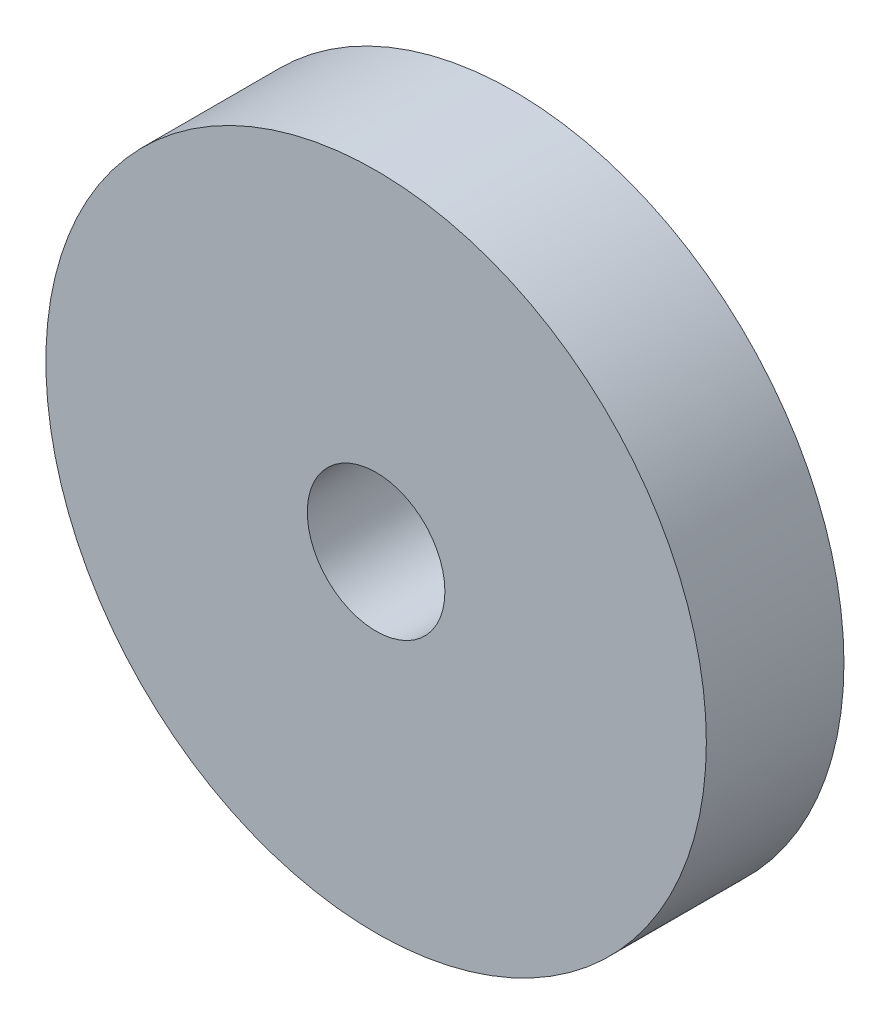
ISO-10303-21;
HEADER;
FILE_DESCRIPTION(('STEP AP214'),'2;1');
FILE_NAME('part.step','',(''),(''),'','','');
FILE_SCHEMA(('AUTOMOTIVE_DESIGN { 1 0 10303 214 1 1 1 1 }'));
ENDSEC;
DATA;
#1=APPLICATION_CONTEXT('core data for automotive mechanical design processes');
#2=APPLICATION_PROTOCOL_DEFINITION('international standard','automotive_design',2000,#1);
#3=PRODUCT_CONTEXT('',#1,'mechanical');
#4=PRODUCT('Part','Part','',(#3));
#5=PRODUCT_RELATED_PRODUCT_CATEGORY('part','',(#4));
#6=PRODUCT_DEFINITION_FORMATION('','',#4);
#7=PRODUCT_DEFINITION_CONTEXT('part definition',#1,'design');
#8=PRODUCT_DEFINITION('design','',#6,#7);
#9=PRODUCT_DEFINITION_SHAPE('','',#8);
#10=(LENGTH_UNIT() NAMED_UNIT(*) SI_UNIT(.MILLI.,.METRE.));
#11=(NAMED_UNIT(*) PLANE_ANGLE_UNIT() SI_UNIT($,.RADIAN.));
#12=(NAMED_UNIT(*) SI_UNIT($,.STERADIAN.) SOLID_ANGLE_UNIT());
#13=UNCERTAINTY_MEASURE_WITH_UNIT(LENGTH_MEASURE(1.E-05),#10,'distance_accuracy_value','');
#14=(GEOMETRIC_REPRESENTATION_CONTEXT(3) GLOBAL_UNCERTAINTY_ASSIGNED_CONTEXT((#13)) GLOBAL_UNIT_ASSIGNED_CONTEXT((#10,
#11,#12)) REPRESENTATION_CONTEXT('',''));
#15=CARTESIAN_POINT('',(0.,0.,0.));
#16=DIRECTION('',(0.,0.,1.));
#17=DIRECTION('',(1.,0.,0.));
#18=AXIS2_PLACEMENT_3D('',#15,#16,#17);
#19=CARTESIAN_POINT('',(0.,0.,15.875));
#20=DIRECTION('',(0.,0.,1.));
#21=DIRECTION('',(1.,0.,0.));
#22=AXIS2_PLACEMENT_3D('',#19,#20,#21);
#23=PLANE('',#22);
#24=CARTESIAN_POINT('',(0.,0.,15.875));
#25=DIRECTION('',(0.,0.,1.));
#26=DIRECTION('',(1.,0.,0.));
#27=AXIS2_PLACEMENT_3D('',#24,#25,#26);
#28=CIRCLE('',#27,38.1);
#29=CARTESIAN_POINT('',(38.1,0.,15.875));
#30=VERTEX_POINT('',#29);
#31=EDGE_CURVE('E10',#30,#30,#28,.T.);
#32=ORIENTED_EDGE('',*,*,#31,.T.);
#33=EDGE_LOOP('',(#32));
#34=FACE_BOUND('',#33,.T.);
#35=CARTESIAN_POINT('',(0.,0.,15.875));
#36=DIRECTION('',(0.,0.,1.));
#37=DIRECTION('',(1.,0.,0.));
#38=AXIS2_PLACEMENT_3D('',#35,#36,#37);
#39=CIRCLE('',#38,7.9375);
#40=CARTESIAN_POINT('',(7.9375,0.,15.875));
#41=VERTEX_POINT('',#40);
#42=EDGE_CURVE('E41',#41,#41,#39,.T.);
#43=ORIENTED_EDGE('',*,*,#42,.F.);
#44=EDGE_LOOP('',(#43));
#45=FACE_BOUND('',#44,.T.);
#46=ADVANCED_FACE('F30',(#34,#45),#23,.T.);
#47=CARTESIAN_POINT('',(0.,0.,0.));
#48=DIRECTION('',(0.,0.,1.));
#49=DIRECTION('',(1.,0.,0.));
#50=AXIS2_PLACEMENT_3D('',#47,#48,#49);
#51=PLANE('',#50);
#52=CARTESIAN_POINT('',(0.,0.,0.));
#53=DIRECTION('',(0.,0.,1.));
#54=DIRECTION('',(1.,0.,0.));
#55=AXIS2_PLACEMENT_3D('',#52,#53,#54);
#56=CIRCLE('',#55,38.1);
#57=CARTESIAN_POINT('',(38.1,0.,0.));
#58=VERTEX_POINT('',#57);
#59=EDGE_CURVE('E34',#58,#58,#56,.T.);
#60=ORIENTED_EDGE('',*,*,#59,.F.);
#61=EDGE_LOOP('',(#60));
#62=FACE_BOUND('',#61,.T.);
#63=CARTESIAN_POINT('',(0.,0.,0.));
#64=DIRECTION('',(0.,0.,1.));
#65=DIRECTION('',(1.,0.,0.));
#66=AXIS2_PLACEMENT_3D('',#63,#64,#65);
#67=CIRCLE('',#66,7.9375);
#68=CARTESIAN_POINT('',(7.9375,0.,0.));
#69=VERTEX_POINT('',#68);
#70=EDGE_CURVE('E43',#69,#69,#67,.T.);
#71=ORIENTED_EDGE('',*,*,#70,.T.);
#72=EDGE_LOOP('',(#71));
#73=FACE_BOUND('',#72,.T.);
#74=ADVANCED_FACE('F53',(#62,#73),#51,.F.);
#75=CARTESIAN_POINT('',(0.,0.,15.875));
#76=DIRECTION('',(0.,0.,-1.));
#77=DIRECTION('',(-1.,0.,0.));
#78=AXIS2_PLACEMENT_3D('',#75,#76,#77);
#79=CYLINDRICAL_SURFACE('',#78,38.1);
#80=ORIENTED_EDGE('',*,*,#31,.F.);
#81=EDGE_LOOP('',(#80));
#82=FACE_BOUND('',#81,.T.);
#83=ORIENTED_EDGE('',*,*,#59,.T.);
#84=EDGE_LOOP('',(#83));
#85=FACE_BOUND('',#84,.T.);
#86=ADVANCED_FACE('F32',(#82,#85),#79,.T.);
#87=CARTESIAN_POINT('',(0.,0.,15.875));
#88=DIRECTION('',(0.,0.,-1.));
#89=DIRECTION('',(-1.,0.,0.));
#90=AXIS2_PLACEMENT_3D('',#87,#88,#89);
#91=CYLINDRICAL_SURFACE('',#90,7.9375);
#92=ORIENTED_EDGE('',*,*,#42,.T.);
#93=EDGE_LOOP('',(#92));
#94=FACE_BOUND('',#93,.T.);
#95=ORIENTED_EDGE('',*,*,#70,.F.);
#96=EDGE_LOOP('',(#95));
#97=FACE_BOUND('',#96,.T.);
#98=ADVANCED_FACE('F49',(#94,#97),#91,.F.);
#99=CLOSED_SHELL('',(#46,#74,#86,#98));
#100=MANIFOLD_SOLID_BREP('B2',#99);
#101=ADVANCED_BREP_SHAPE_REPRESENTATION('',(#18,#100),#14);
#102=SHAPE_DEFINITION_REPRESENTATION(#9,#101);
ENDSEC;
END-ISO-10303-21;
